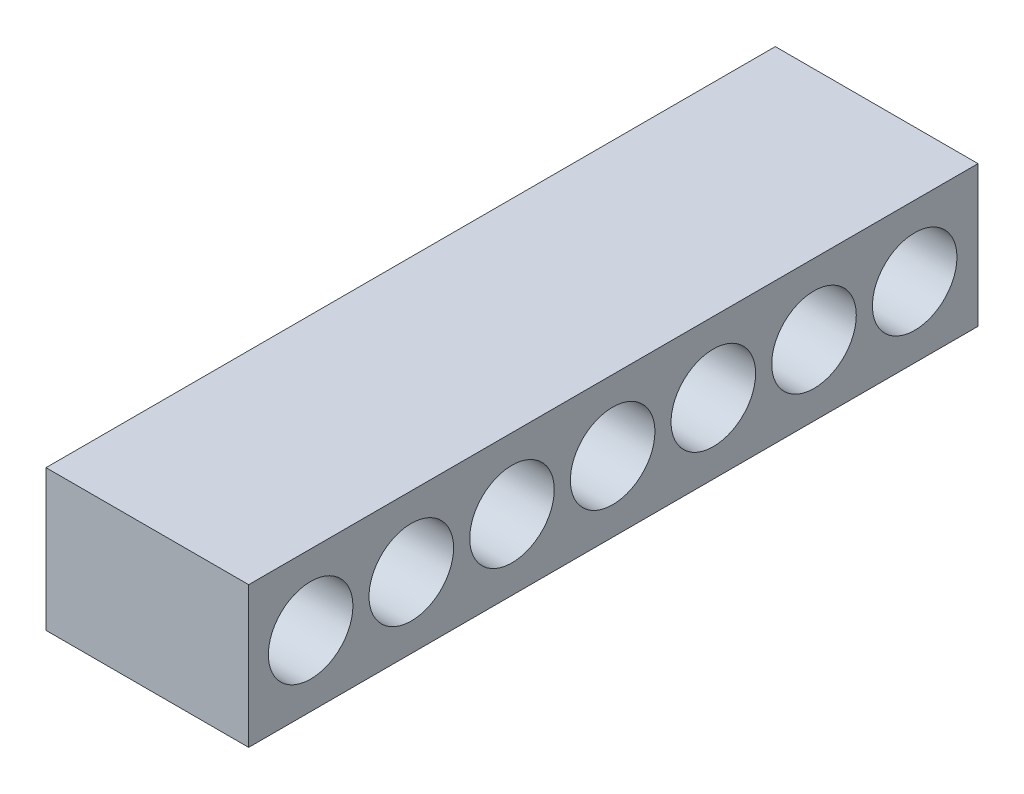
ISO-10303-21;
HEADER;
FILE_DESCRIPTION(('STEP AP214'),'2;1');
FILE_NAME('part.step','',(''),(''),'','','');
FILE_SCHEMA(('AUTOMOTIVE_DESIGN { 1 0 10303 214 1 1 1 1 }'));
ENDSEC;
DATA;
#1=APPLICATION_CONTEXT('core data for automotive mechanical design processes');
#2=APPLICATION_PROTOCOL_DEFINITION('international standard','automotive_design',2000,#1);
#3=PRODUCT_CONTEXT('',#1,'mechanical');
#4=PRODUCT('Part','Part','',(#3));
#5=PRODUCT_RELATED_PRODUCT_CATEGORY('part','',(#4));
#6=PRODUCT_DEFINITION_FORMATION('','',#4);
#7=PRODUCT_DEFINITION_CONTEXT('part definition',#1,'design');
#8=PRODUCT_DEFINITION('design','',#6,#7);
#9=PRODUCT_DEFINITION_SHAPE('','',#8);
#10=(LENGTH_UNIT() NAMED_UNIT(*) SI_UNIT(.MILLI.,.METRE.));
#11=(NAMED_UNIT(*) PLANE_ANGLE_UNIT() SI_UNIT($,.RADIAN.));
#12=(NAMED_UNIT(*) SI_UNIT($,.STERADIAN.) SOLID_ANGLE_UNIT());
#13=UNCERTAINTY_MEASURE_WITH_UNIT(LENGTH_MEASURE(1.E-05),#10,'distance_accuracy_value','');
#14=(GEOMETRIC_REPRESENTATION_CONTEXT(3) GLOBAL_UNCERTAINTY_ASSIGNED_CONTEXT((#13)) GLOBAL_UNIT_ASSIGNED_CONTEXT((#10,
#11,#12)) REPRESENTATION_CONTEXT('',''));
#15=CARTESIAN_POINT('',(0.,0.,0.));
#16=DIRECTION('',(0.,0.,1.));
#17=DIRECTION('',(1.,0.,0.));
#18=AXIS2_PLACEMENT_3D('',#15,#16,#17);
#19=CARTESIAN_POINT('',(1.9177,2.667,-7.5));
#20=DIRECTION('',(-1.,0.,0.));
#21=DIRECTION('',(0.,0.,1.));
#22=AXIS2_PLACEMENT_3D('',#19,#20,#21);
#23=PLANE('',#22);
#24=CARTESIAN_POINT('',(1.9177,1.3335,6.32806973681177));
#25=DIRECTION('',(1.,0.,0.));
#26=DIRECTION('',(0.,0.,-1.));
#27=AXIS2_PLACEMENT_3D('',#24,#25,#26);
#28=CIRCLE('',#27,0.800000000000001);
#29=CARTESIAN_POINT('',(1.9177,1.3335,5.52806973681177));
#30=VERTEX_POINT('',#29);
#31=EDGE_CURVE('E88',#30,#30,#28,.T.);
#32=ORIENTED_EDGE('',*,*,#31,.F.);
#33=EDGE_LOOP('',(#32));
#34=FACE_BOUND('',#33,.T.);
#35=CARTESIAN_POINT('',(1.9177,1.3335,4.42306973681177));
#36=DIRECTION('',(1.,0.,0.));
#37=DIRECTION('',(0.,0.,-1.));
#38=AXIS2_PLACEMENT_3D('',#35,#36,#37);
#39=CIRCLE('',#38,0.8);
#40=CARTESIAN_POINT('',(1.9177,1.3335,3.62306973681177));
#41=VERTEX_POINT('',#40);
#42=EDGE_CURVE('E98',#41,#41,#39,.T.);
#43=ORIENTED_EDGE('',*,*,#42,.F.);
#44=EDGE_LOOP('',(#43));
#45=FACE_BOUND('',#44,.T.);
#46=CARTESIAN_POINT('',(1.9177,1.3335,2.51806973681177));
#47=DIRECTION('',(1.,0.,0.));
#48=DIRECTION('',(0.,0.,-1.));
#49=AXIS2_PLACEMENT_3D('',#46,#47,#48);
#50=CIRCLE('',#49,0.8);
#51=CARTESIAN_POINT('',(1.9177,1.3335,1.71806973681177));
#52=VERTEX_POINT('',#51);
#53=EDGE_CURVE('E104',#52,#52,#50,.T.);
#54=ORIENTED_EDGE('',*,*,#53,.F.);
#55=EDGE_LOOP('',(#54));
#56=FACE_BOUND('',#55,.T.);
#57=CARTESIAN_POINT('',(1.9177,1.3335,0.613069736811771));
#58=DIRECTION('',(1.,0.,0.));
#59=DIRECTION('',(0.,0.,-1.));
#60=AXIS2_PLACEMENT_3D('',#57,#58,#59);
#61=CIRCLE('',#60,0.8);
#62=CARTESIAN_POINT('',(1.9177,1.3335,-0.186930263188229));
#63=VERTEX_POINT('',#62);
#64=EDGE_CURVE('E110',#63,#63,#61,.T.);
#65=ORIENTED_EDGE('',*,*,#64,.F.);
#66=EDGE_LOOP('',(#65));
#67=FACE_BOUND('',#66,.T.);
#68=CARTESIAN_POINT('',(1.9177,1.3335,-1.29193026318823));
#69=DIRECTION('',(1.,0.,0.));
#70=DIRECTION('',(0.,0.,-1.));
#71=AXIS2_PLACEMENT_3D('',#68,#69,#70);
#72=CIRCLE('',#71,0.8);
#73=CARTESIAN_POINT('',(1.9177,1.3335,-2.09193026318823));
#74=VERTEX_POINT('',#73);
#75=EDGE_CURVE('E116',#74,#74,#72,.T.);
#76=ORIENTED_EDGE('',*,*,#75,.F.);
#77=EDGE_LOOP('',(#76));
#78=FACE_BOUND('',#77,.T.);
#79=CARTESIAN_POINT('',(1.9177,1.3335,-3.19693026318823));
#80=DIRECTION('',(1.,0.,0.));
#81=DIRECTION('',(0.,0.,-1.));
#82=AXIS2_PLACEMENT_3D('',#79,#80,#81);
#83=CIRCLE('',#82,0.800000000000001);
#84=CARTESIAN_POINT('',(1.9177,1.3335,-3.99693026318823));
#85=VERTEX_POINT('',#84);
#86=EDGE_CURVE('E122',#85,#85,#83,.T.);
#87=ORIENTED_EDGE('',*,*,#86,.F.);
#88=EDGE_LOOP('',(#87));
#89=FACE_BOUND('',#88,.T.);
#90=CARTESIAN_POINT('',(1.9177,1.3335,-5.10193026318823));
#91=DIRECTION('',(1.,0.,0.));
#92=DIRECTION('',(0.,0.,-1.));
#93=AXIS2_PLACEMENT_3D('',#90,#91,#92);
#94=CIRCLE('',#93,0.8);
#95=CARTESIAN_POINT('',(1.9177,1.3335,-5.90193026318823));
#96=VERTEX_POINT('',#95);
#97=EDGE_CURVE('E128',#96,#96,#94,.T.);
#98=ORIENTED_EDGE('',*,*,#97,.F.);
#99=EDGE_LOOP('',(#98));
#100=FACE_BOUND('',#99,.T.);
#101=DIRECTION('',(0.,-1.,0.));
#102=VECTOR('',#101,1.);
#103=CARTESIAN_POINT('',(1.9177,2.667,-6.3));
#104=LINE('',#103,#102);
#105=CARTESIAN_POINT('',(1.9177,2.667,-6.3));
#106=VERTEX_POINT('',#105);
#107=CARTESIAN_POINT('',(1.9177,0.,-6.3));
#108=VERTEX_POINT('',#107);
#109=EDGE_CURVE('E47',#106,#108,#104,.T.);
#110=ORIENTED_EDGE('',*,*,#109,.F.);
#111=DIRECTION('',(0.,0.,-1.));
#112=VECTOR('',#111,1.);
#113=CARTESIAN_POINT('',(1.9177,2.667,-7.5));
#114=LINE('',#113,#112);
#115=CARTESIAN_POINT('',(1.9177,2.667,7.5));
#116=VERTEX_POINT('',#115);
#117=EDGE_CURVE('E76',#116,#106,#114,.T.);
#118=ORIENTED_EDGE('',*,*,#117,.F.);
#119=DIRECTION('',(0.,-1.,0.));
#120=VECTOR('',#119,1.);
#121=CARTESIAN_POINT('',(1.9177,2.667,7.5));
#122=LINE('',#121,#120);
#123=CARTESIAN_POINT('',(1.9177,0.,7.5));
#124=VERTEX_POINT('',#123);
#125=EDGE_CURVE('E40',#116,#124,#122,.T.);
#126=ORIENTED_EDGE('',*,*,#125,.T.);
#127=DIRECTION('',(0.,0.,-1.));
#128=VECTOR('',#127,1.);
#129=CARTESIAN_POINT('',(1.9177,0.,-7.5));
#130=LINE('',#129,#128);
#131=EDGE_CURVE('E81',#124,#108,#130,.T.);
#132=ORIENTED_EDGE('',*,*,#131,.T.);
#133=EDGE_LOOP('',(#110,#118,#126,#132));
#134=FACE_BOUND('',#133,.T.);
#135=ADVANCED_FACE('F33',(#34,#45,#56,#67,#78,#89,#100,#134),#23,.F.);
#136=CARTESIAN_POINT('',(-1.9177,2.667,-7.5));
#137=DIRECTION('',(1.,0.,0.));
#138=DIRECTION('',(0.,0.,-1.));
#139=AXIS2_PLACEMENT_3D('',#136,#137,#138);
#140=PLANE('',#139);
#141=CARTESIAN_POINT('',(-1.9177,1.3335,6.32806973681177));
#142=DIRECTION('',(1.,0.,0.));
#143=DIRECTION('',(0.,0.,-1.));
#144=AXIS2_PLACEMENT_3D('',#141,#142,#143);
#145=CIRCLE('',#144,0.64);
#146=CARTESIAN_POINT('',(-1.9177,1.3335,5.68806973681177));
#147=VERTEX_POINT('',#146);
#148=EDGE_CURVE('E131',#147,#147,#145,.T.);
#149=ORIENTED_EDGE('',*,*,#148,.T.);
#150=EDGE_LOOP('',(#149));
#151=FACE_BOUND('',#150,.T.);
#152=CARTESIAN_POINT('',(-1.9177,1.3335,4.42306973681177));
#153=DIRECTION('',(1.,0.,0.));
#154=DIRECTION('',(0.,0.,-1.));
#155=AXIS2_PLACEMENT_3D('',#152,#153,#154);
#156=CIRCLE('',#155,0.64);
#157=CARTESIAN_POINT('',(-1.9177,1.3335,3.78306973681177));
#158=VERTEX_POINT('',#157);
#159=EDGE_CURVE('E137',#158,#158,#156,.T.);
#160=ORIENTED_EDGE('',*,*,#159,.T.);
#161=EDGE_LOOP('',(#160));
#162=FACE_BOUND('',#161,.T.);
#163=CARTESIAN_POINT('',(-1.9177,1.3335,2.51806973681177));
#164=DIRECTION('',(1.,0.,0.));
#165=DIRECTION('',(0.,0.,-1.));
#166=AXIS2_PLACEMENT_3D('',#163,#164,#165);
#167=CIRCLE('',#166,0.64);
#168=CARTESIAN_POINT('',(-1.9177,1.3335,1.87806973681177));
#169=VERTEX_POINT('',#168);
#170=EDGE_CURVE('E143',#169,#169,#167,.T.);
#171=ORIENTED_EDGE('',*,*,#170,.T.);
#172=EDGE_LOOP('',(#171));
#173=FACE_BOUND('',#172,.T.);
#174=CARTESIAN_POINT('',(-1.9177,1.3335,0.613069736811771));
#175=DIRECTION('',(1.,0.,0.));
#176=DIRECTION('',(0.,0.,-1.));
#177=AXIS2_PLACEMENT_3D('',#174,#175,#176);
#178=CIRCLE('',#177,0.64);
#179=CARTESIAN_POINT('',(-1.9177,1.3335,-0.0269302631882288));
#180=VERTEX_POINT('',#179);
#181=EDGE_CURVE('E149',#180,#180,#178,.T.);
#182=ORIENTED_EDGE('',*,*,#181,.T.);
#183=EDGE_LOOP('',(#182));
#184=FACE_BOUND('',#183,.T.);
#185=CARTESIAN_POINT('',(-1.9177,1.3335,-1.29193026318823));
#186=DIRECTION('',(1.,0.,0.));
#187=DIRECTION('',(0.,0.,-1.));
#188=AXIS2_PLACEMENT_3D('',#185,#186,#187);
#189=CIRCLE('',#188,0.64);
#190=CARTESIAN_POINT('',(-1.9177,1.3335,-1.93193026318823));
#191=VERTEX_POINT('',#190);
#192=EDGE_CURVE('E155',#191,#191,#189,.T.);
#193=ORIENTED_EDGE('',*,*,#192,.T.);
#194=EDGE_LOOP('',(#193));
#195=FACE_BOUND('',#194,.T.);
#196=CARTESIAN_POINT('',(-1.9177,1.3335,-3.19693026318823));
#197=DIRECTION('',(1.,0.,0.));
#198=DIRECTION('',(0.,0.,-1.));
#199=AXIS2_PLACEMENT_3D('',#196,#197,#198);
#200=CIRCLE('',#199,0.64);
#201=CARTESIAN_POINT('',(-1.9177,1.3335,-3.83693026318823));
#202=VERTEX_POINT('',#201);
#203=EDGE_CURVE('E161',#202,#202,#200,.T.);
#204=ORIENTED_EDGE('',*,*,#203,.T.);
#205=EDGE_LOOP('',(#204));
#206=FACE_BOUND('',#205,.T.);
#207=DIRECTION('',(0.,1.,0.));
#208=VECTOR('',#207,1.);
#209=CARTESIAN_POINT('',(-1.9177,2.667,-6.3));
#210=LINE('',#209,#208);
#211=CARTESIAN_POINT('',(-1.9177,0.,-6.3));
#212=VERTEX_POINT('',#211);
#213=CARTESIAN_POINT('',(-1.9177,2.667,-6.3));
#214=VERTEX_POINT('',#213);
#215=EDGE_CURVE('E177',#212,#214,#210,.T.);
#216=ORIENTED_EDGE('',*,*,#215,.F.);
#217=DIRECTION('',(0.,0.,1.));
#218=VECTOR('',#217,1.);
#219=CARTESIAN_POINT('',(-1.9177,0.,-7.5));
#220=LINE('',#219,#218);
#221=CARTESIAN_POINT('',(-1.9177,0.,7.5));
#222=VERTEX_POINT('',#221);
#223=EDGE_CURVE('E77',#212,#222,#220,.T.);
#224=ORIENTED_EDGE('',*,*,#223,.T.);
#225=DIRECTION('',(0.,-1.,0.));
#226=VECTOR('',#225,1.);
#227=CARTESIAN_POINT('',(-1.9177,2.667,7.5));
#228=LINE('',#227,#226);
#229=CARTESIAN_POINT('',(-1.9177,2.667,7.5));
#230=VERTEX_POINT('',#229);
#231=EDGE_CURVE('E11',#230,#222,#228,.T.);
#232=ORIENTED_EDGE('',*,*,#231,.F.);
#233=DIRECTION('',(0.,0.,1.));
#234=VECTOR('',#233,1.);
#235=CARTESIAN_POINT('',(-1.9177,2.667,-7.5));
#236=LINE('',#235,#234);
#237=EDGE_CURVE('E92',#214,#230,#236,.T.);
#238=ORIENTED_EDGE('',*,*,#237,.F.);
#239=EDGE_LOOP('',(#216,#224,#232,#238));
#240=FACE_BOUND('',#239,.T.);
#241=ADVANCED_FACE('F189',(#151,#162,#173,#184,#195,#206,#240),#140,.F.);
#242=CARTESIAN_POINT('',(0.,2.667,0.));
#243=DIRECTION('',(0.,1.,0.));
#244=DIRECTION('',(0.,0.,1.));
#245=AXIS2_PLACEMENT_3D('',#242,#243,#244);
#246=PLANE('',#245);
#247=ORIENTED_EDGE('',*,*,#117,.T.);
#248=DIRECTION('',(1.,0.,0.));
#249=VECTOR('',#248,1.);
#250=CARTESIAN_POINT('',(1.9177,2.667,-6.3));
#251=LINE('',#250,#249);
#252=EDGE_CURVE('E173',#214,#106,#251,.T.);
#253=ORIENTED_EDGE('',*,*,#252,.F.);
#254=ORIENTED_EDGE('',*,*,#237,.T.);
#255=DIRECTION('',(1.,0.,0.));
#256=VECTOR('',#255,1.);
#257=CARTESIAN_POINT('',(-1.9177,2.667,7.5));
#258=LINE('',#257,#256);
#259=EDGE_CURVE('E56',#230,#116,#258,.T.);
#260=ORIENTED_EDGE('',*,*,#259,.T.);
#261=EDGE_LOOP('',(#247,#253,#254,#260));
#262=FACE_BOUND('',#261,.T.);
#263=ADVANCED_FACE('F191',(#262),#246,.T.);
#264=CARTESIAN_POINT('',(0.,0.,0.));
#265=DIRECTION('',(0.,1.,0.));
#266=DIRECTION('',(0.,0.,1.));
#267=AXIS2_PLACEMENT_3D('',#264,#265,#266);
#268=PLANE('',#267);
#269=DIRECTION('',(-1.,0.,0.));
#270=VECTOR('',#269,1.);
#271=CARTESIAN_POINT('',(1.9177,0.,-6.3));
#272=LINE('',#271,#270);
#273=EDGE_CURVE('E83',#108,#212,#272,.T.);
#274=ORIENTED_EDGE('',*,*,#273,.F.);
#275=ORIENTED_EDGE('',*,*,#131,.F.);
#276=DIRECTION('',(1.,0.,0.));
#277=VECTOR('',#276,1.);
#278=CARTESIAN_POINT('',(-1.9177,0.,7.5));
#279=LINE('',#278,#277);
#280=EDGE_CURVE('E68',#222,#124,#279,.T.);
#281=ORIENTED_EDGE('',*,*,#280,.F.);
#282=ORIENTED_EDGE('',*,*,#223,.F.);
#283=EDGE_LOOP('',(#274,#275,#281,#282));
#284=FACE_BOUND('',#283,.T.);
#285=ADVANCED_FACE('F82',(#284),#268,.F.);
#286=CARTESIAN_POINT('',(-1.9177,2.667,7.5));
#287=DIRECTION('',(0.,0.,-1.));
#288=DIRECTION('',(-1.,0.,0.));
#289=AXIS2_PLACEMENT_3D('',#286,#287,#288);
#290=PLANE('',#289);
#291=ORIENTED_EDGE('',*,*,#280,.T.);
#292=ORIENTED_EDGE('',*,*,#125,.F.);
#293=ORIENTED_EDGE('',*,*,#259,.F.);
#294=ORIENTED_EDGE('',*,*,#231,.T.);
#295=EDGE_LOOP('',(#291,#292,#293,#294));
#296=FACE_BOUND('',#295,.T.);
#297=ADVANCED_FACE('F70',(#296),#290,.F.);
#298=CARTESIAN_POINT('',(0.,1.3335,6.32806973681177));
#299=DIRECTION('',(1.,0.,0.));
#300=DIRECTION('',(0.,0.,-1.));
#301=AXIS2_PLACEMENT_3D('',#298,#299,#300);
#302=CYLINDRICAL_SURFACE('',#301,0.800000000000001);
#303=CARTESIAN_POINT('',(0.,1.3335,6.32806973681177));
#304=DIRECTION('',(1.,0.,0.));
#305=DIRECTION('',(0.,0.,-1.));
#306=AXIS2_PLACEMENT_3D('',#303,#304,#305);
#307=CIRCLE('',#306,0.800000000000001);
#308=CARTESIAN_POINT('',(0.,1.3335,5.52806973681177));
#309=VERTEX_POINT('',#308);
#310=EDGE_CURVE('E84',#309,#309,#307,.T.);
#311=ORIENTED_EDGE('',*,*,#310,.F.);
#312=EDGE_LOOP('',(#311));
#313=FACE_BOUND('',#312,.T.);
#314=ORIENTED_EDGE('',*,*,#31,.T.);
#315=EDGE_LOOP('',(#314));
#316=FACE_BOUND('',#315,.T.);
#317=ADVANCED_FACE('F275',(#313,#316),#302,.F.);
#318=CARTESIAN_POINT('',(0.,1.3335,6.32806973681177));
#319=DIRECTION('',(1.,0.,0.));
#320=DIRECTION('',(0.,0.,-1.));
#321=AXIS2_PLACEMENT_3D('',#318,#319,#320);
#322=PLANE('',#321);
#323=CARTESIAN_POINT('',(0.,1.3335,6.32806973681177));
#324=DIRECTION('',(1.,0.,0.));
#325=DIRECTION('',(0.,0.,-1.));
#326=AXIS2_PLACEMENT_3D('',#323,#324,#325);
#327=CIRCLE('',#326,0.64);
#328=CARTESIAN_POINT('',(0.,1.3335,5.68806973681177));
#329=VERTEX_POINT('',#328);
#330=EDGE_CURVE('E134',#329,#329,#327,.T.);
#331=ORIENTED_EDGE('',*,*,#330,.F.);
#332=EDGE_LOOP('',(#331));
#333=FACE_BOUND('',#332,.T.);
#334=ORIENTED_EDGE('',*,*,#310,.T.);
#335=EDGE_LOOP('',(#334));
#336=FACE_BOUND('',#335,.T.);
#337=ADVANCED_FACE('F272',(#333,#336),#322,.T.);
#338=CARTESIAN_POINT('',(0.,1.3335,4.42306973681177));
#339=DIRECTION('',(1.,0.,0.));
#340=DIRECTION('',(0.,0.,-1.));
#341=AXIS2_PLACEMENT_3D('',#338,#339,#340);
#342=CYLINDRICAL_SURFACE('',#341,0.8);
#343=CARTESIAN_POINT('',(0.,1.3335,4.42306973681177));
#344=DIRECTION('',(1.,0.,0.));
#345=DIRECTION('',(0.,0.,-1.));
#346=AXIS2_PLACEMENT_3D('',#343,#344,#345);
#347=CIRCLE('',#346,0.8);
#348=CARTESIAN_POINT('',(0.,1.3335,3.62306973681177));
#349=VERTEX_POINT('',#348);
#350=EDGE_CURVE('E96',#349,#349,#347,.T.);
#351=ORIENTED_EDGE('',*,*,#350,.F.);
#352=EDGE_LOOP('',(#351));
#353=FACE_BOUND('',#352,.T.);
#354=ORIENTED_EDGE('',*,*,#42,.T.);
#355=EDGE_LOOP('',(#354));
#356=FACE_BOUND('',#355,.T.);
#357=ADVANCED_FACE('F268',(#353,#356),#342,.F.);
#358=CARTESIAN_POINT('',(0.,1.3335,4.42306973681177));
#359=DIRECTION('',(1.,0.,0.));
#360=DIRECTION('',(0.,0.,-1.));
#361=AXIS2_PLACEMENT_3D('',#358,#359,#360);
#362=PLANE('',#361);
#363=CARTESIAN_POINT('',(0.,1.3335,4.42306973681177));
#364=DIRECTION('',(1.,0.,0.));
#365=DIRECTION('',(0.,0.,-1.));
#366=AXIS2_PLACEMENT_3D('',#363,#364,#365);
#367=CIRCLE('',#366,0.64);
#368=CARTESIAN_POINT('',(0.,1.3335,3.78306973681177));
#369=VERTEX_POINT('',#368);
#370=EDGE_CURVE('E140',#369,#369,#367,.T.);
#371=ORIENTED_EDGE('',*,*,#370,.F.);
#372=EDGE_LOOP('',(#371));
#373=FACE_BOUND('',#372,.T.);
#374=ORIENTED_EDGE('',*,*,#350,.T.);
#375=EDGE_LOOP('',(#374));
#376=FACE_BOUND('',#375,.T.);
#377=ADVANCED_FACE('F264',(#373,#376),#362,.T.);
#378=CARTESIAN_POINT('',(0.,1.3335,2.51806973681177));
#379=DIRECTION('',(1.,0.,0.));
#380=DIRECTION('',(0.,0.,-1.));
#381=AXIS2_PLACEMENT_3D('',#378,#379,#380);
#382=CYLINDRICAL_SURFACE('',#381,0.8);
#383=CARTESIAN_POINT('',(0.,1.3335,2.51806973681177));
#384=DIRECTION('',(1.,0.,0.));
#385=DIRECTION('',(0.,0.,-1.));
#386=AXIS2_PLACEMENT_3D('',#383,#384,#385);
#387=CIRCLE('',#386,0.8);
#388=CARTESIAN_POINT('',(0.,1.3335,1.71806973681177));
#389=VERTEX_POINT('',#388);
#390=EDGE_CURVE('E101',#389,#389,#387,.T.);
#391=ORIENTED_EDGE('',*,*,#390,.F.);
#392=EDGE_LOOP('',(#391));
#393=FACE_BOUND('',#392,.T.);
#394=ORIENTED_EDGE('',*,*,#53,.T.);
#395=EDGE_LOOP('',(#394));
#396=FACE_BOUND('',#395,.T.);
#397=ADVANCED_FACE('F260',(#393,#396),#382,.F.);
#398=CARTESIAN_POINT('',(0.,1.3335,2.51806973681177));
#399=DIRECTION('',(1.,0.,0.));
#400=DIRECTION('',(0.,0.,-1.));
#401=AXIS2_PLACEMENT_3D('',#398,#399,#400);
#402=PLANE('',#401);
#403=CARTESIAN_POINT('',(0.,1.3335,2.51806973681177));
#404=DIRECTION('',(1.,0.,0.));
#405=DIRECTION('',(0.,0.,-1.));
#406=AXIS2_PLACEMENT_3D('',#403,#404,#405);
#407=CIRCLE('',#406,0.64);
#408=CARTESIAN_POINT('',(0.,1.3335,1.87806973681177));
#409=VERTEX_POINT('',#408);
#410=EDGE_CURVE('E146',#409,#409,#407,.T.);
#411=ORIENTED_EDGE('',*,*,#410,.F.);
#412=EDGE_LOOP('',(#411));
#413=FACE_BOUND('',#412,.T.);
#414=ORIENTED_EDGE('',*,*,#390,.T.);
#415=EDGE_LOOP('',(#414));
#416=FACE_BOUND('',#415,.T.);
#417=ADVANCED_FACE('F256',(#413,#416),#402,.T.);
#418=CARTESIAN_POINT('',(0.,1.3335,0.613069736811771));
#419=DIRECTION('',(1.,0.,0.));
#420=DIRECTION('',(0.,0.,-1.));
#421=AXIS2_PLACEMENT_3D('',#418,#419,#420);
#422=CYLINDRICAL_SURFACE('',#421,0.8);
#423=CARTESIAN_POINT('',(0.,1.3335,0.613069736811771));
#424=DIRECTION('',(1.,0.,0.));
#425=DIRECTION('',(0.,0.,-1.));
#426=AXIS2_PLACEMENT_3D('',#423,#424,#425);
#427=CIRCLE('',#426,0.8);
#428=CARTESIAN_POINT('',(0.,1.3335,-0.186930263188229));
#429=VERTEX_POINT('',#428);
#430=EDGE_CURVE('E107',#429,#429,#427,.T.);
#431=ORIENTED_EDGE('',*,*,#430,.F.);
#432=EDGE_LOOP('',(#431));
#433=FACE_BOUND('',#432,.T.);
#434=ORIENTED_EDGE('',*,*,#64,.T.);
#435=EDGE_LOOP('',(#434));
#436=FACE_BOUND('',#435,.T.);
#437=ADVANCED_FACE('F252',(#433,#436),#422,.F.);
#438=CARTESIAN_POINT('',(0.,1.3335,0.613069736811771));
#439=DIRECTION('',(1.,0.,0.));
#440=DIRECTION('',(0.,0.,-1.));
#441=AXIS2_PLACEMENT_3D('',#438,#439,#440);
#442=PLANE('',#441);
#443=CARTESIAN_POINT('',(0.,1.3335,0.613069736811771));
#444=DIRECTION('',(1.,0.,0.));
#445=DIRECTION('',(0.,0.,-1.));
#446=AXIS2_PLACEMENT_3D('',#443,#444,#445);
#447=CIRCLE('',#446,0.64);
#448=CARTESIAN_POINT('',(0.,1.3335,-0.026930263188229));
#449=VERTEX_POINT('',#448);
#450=EDGE_CURVE('E152',#449,#449,#447,.T.);
#451=ORIENTED_EDGE('',*,*,#450,.F.);
#452=EDGE_LOOP('',(#451));
#453=FACE_BOUND('',#452,.T.);
#454=ORIENTED_EDGE('',*,*,#430,.T.);
#455=EDGE_LOOP('',(#454));
#456=FACE_BOUND('',#455,.T.);
#457=ADVANCED_FACE('F248',(#453,#456),#442,.T.);
#458=CARTESIAN_POINT('',(0.,1.3335,-1.29193026318823));
#459=DIRECTION('',(1.,0.,0.));
#460=DIRECTION('',(0.,0.,-1.));
#461=AXIS2_PLACEMENT_3D('',#458,#459,#460);
#462=CYLINDRICAL_SURFACE('',#461,0.8);
#463=CARTESIAN_POINT('',(0.,1.3335,-1.29193026318823));
#464=DIRECTION('',(1.,0.,0.));
#465=DIRECTION('',(0.,0.,-1.));
#466=AXIS2_PLACEMENT_3D('',#463,#464,#465);
#467=CIRCLE('',#466,0.8);
#468=CARTESIAN_POINT('',(0.,1.3335,-2.09193026318823));
#469=VERTEX_POINT('',#468);
#470=EDGE_CURVE('E113',#469,#469,#467,.T.);
#471=ORIENTED_EDGE('',*,*,#470,.F.);
#472=EDGE_LOOP('',(#471));
#473=FACE_BOUND('',#472,.T.);
#474=ORIENTED_EDGE('',*,*,#75,.T.);
#475=EDGE_LOOP('',(#474));
#476=FACE_BOUND('',#475,.T.);
#477=ADVANCED_FACE('F244',(#473,#476),#462,.F.);
#478=CARTESIAN_POINT('',(0.,1.3335,-1.29193026318823));
#479=DIRECTION('',(1.,0.,0.));
#480=DIRECTION('',(0.,0.,-1.));
#481=AXIS2_PLACEMENT_3D('',#478,#479,#480);
#482=PLANE('',#481);
#483=CARTESIAN_POINT('',(0.,1.3335,-1.29193026318823));
#484=DIRECTION('',(1.,0.,0.));
#485=DIRECTION('',(0.,0.,-1.));
#486=AXIS2_PLACEMENT_3D('',#483,#484,#485);
#487=CIRCLE('',#486,0.64);
#488=CARTESIAN_POINT('',(0.,1.3335,-1.93193026318823));
#489=VERTEX_POINT('',#488);
#490=EDGE_CURVE('E158',#489,#489,#487,.T.);
#491=ORIENTED_EDGE('',*,*,#490,.F.);
#492=EDGE_LOOP('',(#491));
#493=FACE_BOUND('',#492,.T.);
#494=ORIENTED_EDGE('',*,*,#470,.T.);
#495=EDGE_LOOP('',(#494));
#496=FACE_BOUND('',#495,.T.);
#497=ADVANCED_FACE('F240',(#493,#496),#482,.T.);
#498=CARTESIAN_POINT('',(0.,1.3335,-3.19693026318823));
#499=DIRECTION('',(1.,0.,0.));
#500=DIRECTION('',(0.,0.,-1.));
#501=AXIS2_PLACEMENT_3D('',#498,#499,#500);
#502=CYLINDRICAL_SURFACE('',#501,0.800000000000001);
#503=CARTESIAN_POINT('',(0.,1.3335,-3.19693026318823));
#504=DIRECTION('',(1.,0.,0.));
#505=DIRECTION('',(0.,0.,-1.));
#506=AXIS2_PLACEMENT_3D('',#503,#504,#505);
#507=CIRCLE('',#506,0.800000000000001);
#508=CARTESIAN_POINT('',(0.,1.3335,-3.99693026318823));
#509=VERTEX_POINT('',#508);
#510=EDGE_CURVE('E119',#509,#509,#507,.T.);
#511=ORIENTED_EDGE('',*,*,#510,.F.);
#512=EDGE_LOOP('',(#511));
#513=FACE_BOUND('',#512,.T.);
#514=ORIENTED_EDGE('',*,*,#86,.T.);
#515=EDGE_LOOP('',(#514));
#516=FACE_BOUND('',#515,.T.);
#517=ADVANCED_FACE('F232',(#513,#516),#502,.F.);
#518=CARTESIAN_POINT('',(0.,1.3335,-3.19693026318823));
#519=DIRECTION('',(1.,0.,0.));
#520=DIRECTION('',(0.,0.,-1.));
#521=AXIS2_PLACEMENT_3D('',#518,#519,#520);
#522=PLANE('',#521);
#523=CARTESIAN_POINT('',(0.,1.3335,-3.19693026318823));
#524=DIRECTION('',(1.,0.,0.));
#525=DIRECTION('',(0.,0.,-1.));
#526=AXIS2_PLACEMENT_3D('',#523,#524,#525);
#527=CIRCLE('',#526,0.64);
#528=CARTESIAN_POINT('',(0.,1.3335,-3.83693026318823));
#529=VERTEX_POINT('',#528);
#530=EDGE_CURVE('E164',#529,#529,#527,.T.);
#531=ORIENTED_EDGE('',*,*,#530,.F.);
#532=EDGE_LOOP('',(#531));
#533=FACE_BOUND('',#532,.T.);
#534=ORIENTED_EDGE('',*,*,#510,.T.);
#535=EDGE_LOOP('',(#534));
#536=FACE_BOUND('',#535,.T.);
#537=ADVANCED_FACE('F222',(#533,#536),#522,.T.);
#538=CARTESIAN_POINT('',(0.,1.3335,-5.10193026318823));
#539=DIRECTION('',(1.,0.,0.));
#540=DIRECTION('',(0.,0.,-1.));
#541=AXIS2_PLACEMENT_3D('',#538,#539,#540);
#542=CYLINDRICAL_SURFACE('',#541,0.8);
#543=CARTESIAN_POINT('',(0.,1.3335,-5.10193026318823));
#544=DIRECTION('',(1.,0.,0.));
#545=DIRECTION('',(0.,0.,-1.));
#546=AXIS2_PLACEMENT_3D('',#543,#544,#545);
#547=CIRCLE('',#546,0.8);
#548=CARTESIAN_POINT('',(0.,1.3335,-5.90193026318823));
#549=VERTEX_POINT('',#548);
#550=EDGE_CURVE('E125',#549,#549,#547,.T.);
#551=ORIENTED_EDGE('',*,*,#550,.F.);
#552=EDGE_LOOP('',(#551));
#553=FACE_BOUND('',#552,.T.);
#554=ORIENTED_EDGE('',*,*,#97,.T.);
#555=EDGE_LOOP('',(#554));
#556=FACE_BOUND('',#555,.T.);
#557=ADVANCED_FACE('F219',(#553,#556),#542,.F.);
#558=CARTESIAN_POINT('',(0.,1.3335,-5.10193026318823));
#559=DIRECTION('',(1.,0.,0.));
#560=DIRECTION('',(0.,0.,-1.));
#561=AXIS2_PLACEMENT_3D('',#558,#559,#560);
#562=PLANE('',#561);
#563=CARTESIAN_POINT('',(0.,1.3335,-5.10193026318823));
#564=DIRECTION('',(1.,0.,0.));
#565=DIRECTION('',(0.,0.,-1.));
#566=AXIS2_PLACEMENT_3D('',#563,#564,#565);
#567=CIRCLE('',#566,0.69);
#568=CARTESIAN_POINT('',(0.,1.3335,-5.79193026318823));
#569=VERTEX_POINT('',#568);
#570=EDGE_CURVE('E170',#569,#569,#567,.T.);
#571=ORIENTED_EDGE('',*,*,#570,.F.);
#572=EDGE_LOOP('',(#571));
#573=FACE_BOUND('',#572,.T.);
#574=ORIENTED_EDGE('',*,*,#550,.T.);
#575=EDGE_LOOP('',(#574));
#576=FACE_BOUND('',#575,.T.);
#577=ADVANCED_FACE('F221',(#573,#576),#562,.T.);
#578=CARTESIAN_POINT('',(-1.9177,1.3335,6.32806973681177));
#579=DIRECTION('',(1.,0.,0.));
#580=DIRECTION('',(0.,0.,-1.));
#581=AXIS2_PLACEMENT_3D('',#578,#579,#580);
#582=CYLINDRICAL_SURFACE('',#581,0.64);
#583=ORIENTED_EDGE('',*,*,#148,.F.);
#584=EDGE_LOOP('',(#583));
#585=FACE_BOUND('',#584,.T.);
#586=ORIENTED_EDGE('',*,*,#330,.T.);
#587=EDGE_LOOP('',(#586));
#588=FACE_BOUND('',#587,.T.);
#589=ADVANCED_FACE('F229',(#585,#588),#582,.F.);
#590=CARTESIAN_POINT('',(-1.9177,1.3335,4.42306973681177));
#591=DIRECTION('',(1.,0.,0.));
#592=DIRECTION('',(0.,0.,-1.));
#593=AXIS2_PLACEMENT_3D('',#590,#591,#592);
#594=CYLINDRICAL_SURFACE('',#593,0.64);
#595=ORIENTED_EDGE('',*,*,#159,.F.);
#596=EDGE_LOOP('',(#595));
#597=FACE_BOUND('',#596,.T.);
#598=ORIENTED_EDGE('',*,*,#370,.T.);
#599=EDGE_LOOP('',(#598));
#600=FACE_BOUND('',#599,.T.);
#601=ADVANCED_FACE('F354',(#597,#600),#594,.F.);
#602=CARTESIAN_POINT('',(-1.9177,1.3335,2.51806973681177));
#603=DIRECTION('',(1.,0.,0.));
#604=DIRECTION('',(0.,0.,-1.));
#605=AXIS2_PLACEMENT_3D('',#602,#603,#604);
#606=CYLINDRICAL_SURFACE('',#605,0.64);
#607=ORIENTED_EDGE('',*,*,#170,.F.);
#608=EDGE_LOOP('',(#607));
#609=FACE_BOUND('',#608,.T.);
#610=ORIENTED_EDGE('',*,*,#410,.T.);
#611=EDGE_LOOP('',(#610));
#612=FACE_BOUND('',#611,.T.);
#613=ADVANCED_FACE('F346',(#609,#612),#606,.F.);
#614=CARTESIAN_POINT('',(-1.9177,1.3335,0.613069736811771));
#615=DIRECTION('',(1.,0.,0.));
#616=DIRECTION('',(0.,0.,-1.));
#617=AXIS2_PLACEMENT_3D('',#614,#615,#616);
#618=CYLINDRICAL_SURFACE('',#617,0.64);
#619=ORIENTED_EDGE('',*,*,#181,.F.);
#620=EDGE_LOOP('',(#619));
#621=FACE_BOUND('',#620,.T.);
#622=ORIENTED_EDGE('',*,*,#450,.T.);
#623=EDGE_LOOP('',(#622));
#624=FACE_BOUND('',#623,.T.);
#625=ADVANCED_FACE('F338',(#621,#624),#618,.F.);
#626=CARTESIAN_POINT('',(-1.9177,1.3335,-1.29193026318823));
#627=DIRECTION('',(1.,0.,0.));
#628=DIRECTION('',(0.,0.,-1.));
#629=AXIS2_PLACEMENT_3D('',#626,#627,#628);
#630=CYLINDRICAL_SURFACE('',#629,0.64);
#631=ORIENTED_EDGE('',*,*,#192,.F.);
#632=EDGE_LOOP('',(#631));
#633=FACE_BOUND('',#632,.T.);
#634=ORIENTED_EDGE('',*,*,#490,.T.);
#635=EDGE_LOOP('',(#634));
#636=FACE_BOUND('',#635,.T.);
#637=ADVANCED_FACE('F330',(#633,#636),#630,.F.);
#638=CARTESIAN_POINT('',(-1.9177,1.3335,-3.19693026318823));
#639=DIRECTION('',(1.,0.,0.));
#640=DIRECTION('',(0.,0.,-1.));
#641=AXIS2_PLACEMENT_3D('',#638,#639,#640);
#642=CYLINDRICAL_SURFACE('',#641,0.64);
#643=ORIENTED_EDGE('',*,*,#203,.F.);
#644=EDGE_LOOP('',(#643));
#645=FACE_BOUND('',#644,.T.);
#646=ORIENTED_EDGE('',*,*,#530,.T.);
#647=EDGE_LOOP('',(#646));
#648=FACE_BOUND('',#647,.T.);
#649=ADVANCED_FACE('F321',(#645,#648),#642,.F.);
#650=CARTESIAN_POINT('',(-1.27,1.3335,-5.10193026318823));
#651=DIRECTION('',(1.,0.,0.));
#652=DIRECTION('',(0.,0.,-1.));
#653=AXIS2_PLACEMENT_3D('',#650,#651,#652);
#654=CYLINDRICAL_SURFACE('',#653,0.69);
#655=CARTESIAN_POINT('',(-1.27,1.3335,-5.10193026318823));
#656=DIRECTION('',(1.,0.,0.));
#657=DIRECTION('',(0.,0.,-1.));
#658=AXIS2_PLACEMENT_3D('',#655,#656,#657);
#659=CIRCLE('',#658,0.69);
#660=CARTESIAN_POINT('',(-1.27,1.3335,-5.79193026318823));
#661=VERTEX_POINT('',#660);
#662=EDGE_CURVE('E167',#661,#661,#659,.T.);
#663=ORIENTED_EDGE('',*,*,#662,.F.);
#664=EDGE_LOOP('',(#663));
#665=FACE_BOUND('',#664,.T.);
#666=ORIENTED_EDGE('',*,*,#570,.T.);
#667=EDGE_LOOP('',(#666));
#668=FACE_BOUND('',#667,.T.);
#669=ADVANCED_FACE('F314',(#665,#668),#654,.F.);
#670=CARTESIAN_POINT('',(-1.27,1.3335,-5.10193026318823));
#671=DIRECTION('',(1.,0.,0.));
#672=DIRECTION('',(0.,0.,-1.));
#673=AXIS2_PLACEMENT_3D('',#670,#671,#672);
#674=PLANE('',#673);
#675=ORIENTED_EDGE('',*,*,#662,.T.);
#676=EDGE_LOOP('',(#675));
#677=FACE_BOUND('',#676,.T.);
#678=ADVANCED_FACE('F304',(#677),#674,.T.);
#679=CARTESIAN_POINT('',(0.,0.,-6.3));
#680=DIRECTION('',(0.,0.,-1.));
#681=DIRECTION('',(-1.,0.,0.));
#682=AXIS2_PLACEMENT_3D('',#679,#680,#681);
#683=PLANE('',#682);
#684=ORIENTED_EDGE('',*,*,#109,.T.);
#685=ORIENTED_EDGE('',*,*,#273,.T.);
#686=ORIENTED_EDGE('',*,*,#215,.T.);
#687=ORIENTED_EDGE('',*,*,#252,.T.);
#688=EDGE_LOOP('',(#684,#685,#686,#687));
#689=FACE_BOUND('',#688,.T.);
#690=ADVANCED_FACE('F183',(#689),#683,.T.);
#691=CLOSED_SHELL('',(#135,#241,#263,#285,#297,#317,#337,#357,#377,#397,#417,#437,#457,#477,
#497,#517,#537,#557,#577,#589,#601,#613,#625,#637,#649,#669,#678,#690));
#692=MANIFOLD_SOLID_BREP('B2',#691);
#693=ADVANCED_BREP_SHAPE_REPRESENTATION('',(#18,#692),#14);
#694=SHAPE_DEFINITION_REPRESENTATION(#9,#693);
ENDSEC;
END-ISO-10303-21;
